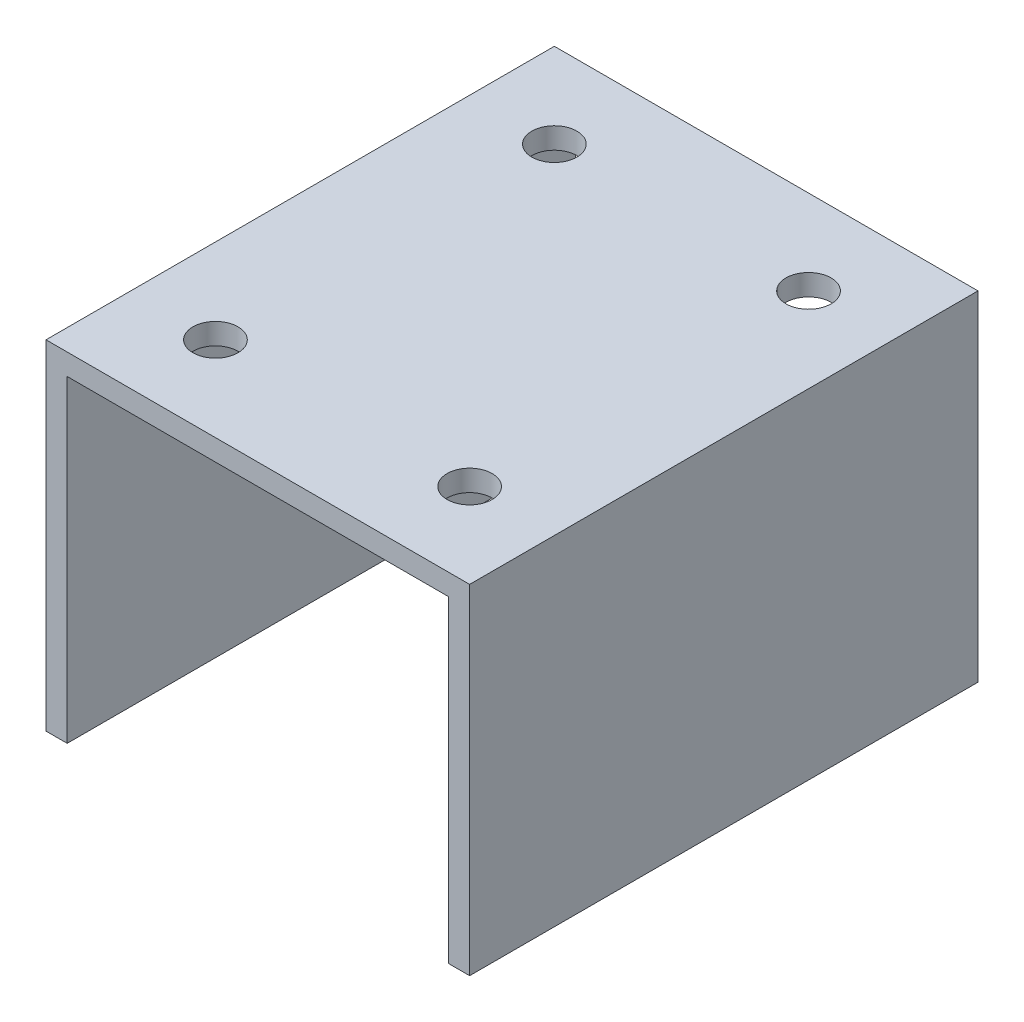
ISO-10303-21;
HEADER;
FILE_DESCRIPTION(('STEP AP214'),'2;1');
FILE_NAME('part.step','',(''),(''),'','','');
FILE_SCHEMA(('AUTOMOTIVE_DESIGN { 1 0 10303 214 1 1 1 1 }'));
ENDSEC;
DATA;
#1=APPLICATION_CONTEXT('core data for automotive mechanical design processes');
#2=APPLICATION_PROTOCOL_DEFINITION('international standard','automotive_design',2000,#1);
#3=PRODUCT_CONTEXT('',#1,'mechanical');
#4=PRODUCT('Part','Part','',(#3));
#5=PRODUCT_RELATED_PRODUCT_CATEGORY('part','',(#4));
#6=PRODUCT_DEFINITION_FORMATION('','',#4);
#7=PRODUCT_DEFINITION_CONTEXT('part definition',#1,'design');
#8=PRODUCT_DEFINITION('design','',#6,#7);
#9=PRODUCT_DEFINITION_SHAPE('','',#8);
#10=(LENGTH_UNIT() NAMED_UNIT(*) SI_UNIT(.MILLI.,.METRE.));
#11=(NAMED_UNIT(*) PLANE_ANGLE_UNIT() SI_UNIT($,.RADIAN.));
#12=(NAMED_UNIT(*) SI_UNIT($,.STERADIAN.) SOLID_ANGLE_UNIT());
#13=UNCERTAINTY_MEASURE_WITH_UNIT(LENGTH_MEASURE(1.E-05),#10,'distance_accuracy_value','');
#14=(GEOMETRIC_REPRESENTATION_CONTEXT(3) GLOBAL_UNCERTAINTY_ASSIGNED_CONTEXT((#13)) GLOBAL_UNIT_ASSIGNED_CONTEXT((#10,
#11,#12)) REPRESENTATION_CONTEXT('',''));
#15=CARTESIAN_POINT('',(0.,0.,0.));
#16=DIRECTION('',(0.,0.,1.));
#17=DIRECTION('',(1.,0.,0.));
#18=AXIS2_PLACEMENT_3D('',#15,#16,#17);
#19=CARTESIAN_POINT('',(-31.75,3.175,38.1));
#20=DIRECTION('',(1.,0.,0.));
#21=DIRECTION('',(0.,0.,-1.));
#22=AXIS2_PLACEMENT_3D('',#19,#20,#21);
#23=PLANE('',#22);
#24=DIRECTION('',(0.,-1.,0.));
#25=VECTOR('',#24,1.);
#26=CARTESIAN_POINT('',(-31.75,3.175,-38.1));
#27=LINE('',#26,#25);
#28=CARTESIAN_POINT('',(-31.75,3.175,-38.1));
#29=VERTEX_POINT('',#28);
#30=CARTESIAN_POINT('',(-31.75,-47.625,-38.1));
#31=VERTEX_POINT('',#30);
#32=EDGE_CURVE('E130',#29,#31,#27,.T.);
#33=ORIENTED_EDGE('',*,*,#32,.T.);
#34=DIRECTION('',(0.,0.,-1.));
#35=VECTOR('',#34,1.);
#36=CARTESIAN_POINT('',(-31.75,-47.625,38.1));
#37=LINE('',#36,#35);
#38=CARTESIAN_POINT('',(-31.75,-47.625,38.1));
#39=VERTEX_POINT('',#38);
#40=EDGE_CURVE('E11',#39,#31,#37,.T.);
#41=ORIENTED_EDGE('',*,*,#40,.F.);
#42=DIRECTION('',(0.,-1.,0.));
#43=VECTOR('',#42,1.);
#44=CARTESIAN_POINT('',(-31.75,3.175,38.1));
#45=LINE('',#44,#43);
#46=CARTESIAN_POINT('',(-31.75,3.175,38.1));
#47=VERTEX_POINT('',#46);
#48=EDGE_CURVE('E145',#47,#39,#45,.T.);
#49=ORIENTED_EDGE('',*,*,#48,.F.);
#50=DIRECTION('',(0.,0.,-1.));
#51=VECTOR('',#50,1.);
#52=CARTESIAN_POINT('',(-31.75,3.175,38.1));
#53=LINE('',#52,#51);
#54=EDGE_CURVE('E126',#47,#29,#53,.T.);
#55=ORIENTED_EDGE('',*,*,#54,.T.);
#56=EDGE_LOOP('',(#33,#41,#49,#55));
#57=FACE_BOUND('',#56,.T.);
#58=ADVANCED_FACE('F33',(#57),#23,.F.);
#59=CARTESIAN_POINT('',(-31.75,-47.625,38.1));
#60=DIRECTION('',(0.,1.,0.));
#61=DIRECTION('',(0.,0.,1.));
#62=AXIS2_PLACEMENT_3D('',#59,#60,#61);
#63=PLANE('',#62);
#64=DIRECTION('',(1.,0.,0.));
#65=VECTOR('',#64,1.);
#66=CARTESIAN_POINT('',(-31.75,-47.625,-38.1));
#67=LINE('',#66,#65);
#68=CARTESIAN_POINT('',(-28.575,-47.625,-38.1));
#69=VERTEX_POINT('',#68);
#70=EDGE_CURVE('E133',#31,#69,#67,.T.);
#71=ORIENTED_EDGE('',*,*,#70,.T.);
#72=DIRECTION('',(0.,0.,-1.));
#73=VECTOR('',#72,1.);
#74=CARTESIAN_POINT('',(-28.575,-47.625,38.1));
#75=LINE('',#74,#73);
#76=CARTESIAN_POINT('',(-28.575,-47.625,38.1));
#77=VERTEX_POINT('',#76);
#78=EDGE_CURVE('E42',#77,#69,#75,.T.);
#79=ORIENTED_EDGE('',*,*,#78,.F.);
#80=DIRECTION('',(1.,0.,0.));
#81=VECTOR('',#80,1.);
#82=CARTESIAN_POINT('',(-31.75,-47.625,38.1));
#83=LINE('',#82,#81);
#84=EDGE_CURVE('E93',#39,#77,#83,.T.);
#85=ORIENTED_EDGE('',*,*,#84,.F.);
#86=ORIENTED_EDGE('',*,*,#40,.T.);
#87=EDGE_LOOP('',(#71,#79,#85,#86));
#88=FACE_BOUND('',#87,.T.);
#89=ADVANCED_FACE('F229',(#88),#63,.F.);
#90=CARTESIAN_POINT('',(-28.575,-47.625,38.1));
#91=DIRECTION('',(-1.,0.,0.));
#92=DIRECTION('',(0.,-1.,0.));
#93=AXIS2_PLACEMENT_3D('',#90,#91,#92);
#94=PLANE('',#93);
#95=DIRECTION('',(0.,1.,0.));
#96=VECTOR('',#95,1.);
#97=CARTESIAN_POINT('',(-28.575,-47.625,-38.1));
#98=LINE('',#97,#96);
#99=CARTESIAN_POINT('',(-28.575,0.,-38.1));
#100=VERTEX_POINT('',#99);
#101=EDGE_CURVE('E136',#69,#100,#98,.T.);
#102=ORIENTED_EDGE('',*,*,#101,.T.);
#103=DIRECTION('',(0.,0.,-1.));
#104=VECTOR('',#103,1.);
#105=CARTESIAN_POINT('',(-28.575,0.,38.1));
#106=LINE('',#105,#104);
#107=CARTESIAN_POINT('',(-28.575,0.,38.1));
#108=VERTEX_POINT('',#107);
#109=EDGE_CURVE('E152',#108,#100,#106,.T.);
#110=ORIENTED_EDGE('',*,*,#109,.F.);
#111=DIRECTION('',(0.,1.,0.));
#112=VECTOR('',#111,1.);
#113=CARTESIAN_POINT('',(-28.575,-47.625,38.1));
#114=LINE('',#113,#112);
#115=EDGE_CURVE('E161',#77,#108,#114,.T.);
#116=ORIENTED_EDGE('',*,*,#115,.F.);
#117=ORIENTED_EDGE('',*,*,#78,.T.);
#118=EDGE_LOOP('',(#102,#110,#116,#117));
#119=FACE_BOUND('',#118,.T.);
#120=ADVANCED_FACE('F159',(#119),#94,.F.);
#121=CARTESIAN_POINT('',(-28.575,0.,38.1));
#122=DIRECTION('',(0.,1.,0.));
#123=DIRECTION('',(0.,0.,1.));
#124=AXIS2_PLACEMENT_3D('',#121,#122,#123);
#125=PLANE('',#124);
#126=CARTESIAN_POINT('',(-19.05,0.,-25.4));
#127=DIRECTION('',(0.,1.,0.));
#128=DIRECTION('',(0.,0.,1.));
#129=AXIS2_PLACEMENT_3D('',#126,#127,#128);
#130=CIRCLE('',#129,3.37819999999999);
#131=CARTESIAN_POINT('',(-19.05,0.,-22.0218));
#132=VERTEX_POINT('',#131);
#133=EDGE_CURVE('E193',#132,#132,#130,.T.);
#134=ORIENTED_EDGE('',*,*,#133,.T.);
#135=EDGE_LOOP('',(#134));
#136=FACE_BOUND('',#135,.T.);
#137=CARTESIAN_POINT('',(19.05,0.,-25.4));
#138=DIRECTION('',(0.,1.,0.));
#139=DIRECTION('',(0.,0.,1.));
#140=AXIS2_PLACEMENT_3D('',#137,#138,#139);
#141=CIRCLE('',#140,3.37819999999999);
#142=CARTESIAN_POINT('',(19.05,0.,-22.0218));
#143=VERTEX_POINT('',#142);
#144=EDGE_CURVE('E187',#143,#143,#141,.T.);
#145=ORIENTED_EDGE('',*,*,#144,.T.);
#146=EDGE_LOOP('',(#145));
#147=FACE_BOUND('',#146,.T.);
#148=CARTESIAN_POINT('',(19.05,0.,25.4));
#149=DIRECTION('',(0.,1.,0.));
#150=DIRECTION('',(0.,0.,1.));
#151=AXIS2_PLACEMENT_3D('',#148,#149,#150);
#152=CIRCLE('',#151,3.37819999999999);
#153=CARTESIAN_POINT('',(19.05,0.,28.7782));
#154=VERTEX_POINT('',#153);
#155=EDGE_CURVE('E36',#154,#154,#152,.T.);
#156=ORIENTED_EDGE('',*,*,#155,.T.);
#157=EDGE_LOOP('',(#156));
#158=FACE_BOUND('',#157,.T.);
#159=CARTESIAN_POINT('',(-19.05,0.,25.4));
#160=DIRECTION('',(0.,1.,0.));
#161=DIRECTION('',(0.,0.,1.));
#162=AXIS2_PLACEMENT_3D('',#159,#160,#161);
#163=CIRCLE('',#162,3.37819999999999);
#164=CARTESIAN_POINT('',(-19.05,0.,28.7782));
#165=VERTEX_POINT('',#164);
#166=EDGE_CURVE('E134',#165,#165,#163,.T.);
#167=ORIENTED_EDGE('',*,*,#166,.T.);
#168=EDGE_LOOP('',(#167));
#169=FACE_BOUND('',#168,.T.);
#170=DIRECTION('',(1.,0.,0.));
#171=VECTOR('',#170,1.);
#172=CARTESIAN_POINT('',(-28.575,0.,-38.1));
#173=LINE('',#172,#171);
#174=CARTESIAN_POINT('',(28.575,0.,-38.1));
#175=VERTEX_POINT('',#174);
#176=EDGE_CURVE('E138',#100,#175,#173,.T.);
#177=ORIENTED_EDGE('',*,*,#176,.T.);
#178=DIRECTION('',(0.,0.,-1.));
#179=VECTOR('',#178,1.);
#180=CARTESIAN_POINT('',(28.575,0.,38.1));
#181=LINE('',#180,#179);
#182=CARTESIAN_POINT('',(28.575,0.,38.1));
#183=VERTEX_POINT('',#182);
#184=EDGE_CURVE('E149',#183,#175,#181,.T.);
#185=ORIENTED_EDGE('',*,*,#184,.F.);
#186=DIRECTION('',(1.,0.,0.));
#187=VECTOR('',#186,1.);
#188=CARTESIAN_POINT('',(-28.575,0.,38.1));
#189=LINE('',#188,#187);
#190=EDGE_CURVE('E173',#108,#183,#189,.T.);
#191=ORIENTED_EDGE('',*,*,#190,.F.);
#192=ORIENTED_EDGE('',*,*,#109,.T.);
#193=EDGE_LOOP('',(#177,#185,#191,#192));
#194=FACE_BOUND('',#193,.T.);
#195=ADVANCED_FACE('F169',(#136,#147,#158,#169,#194),#125,.F.);
#196=CARTESIAN_POINT('',(28.575,-47.625,38.1));
#197=DIRECTION('',(1.,0.,0.));
#198=DIRECTION('',(0.,1.,0.));
#199=AXIS2_PLACEMENT_3D('',#196,#197,#198);
#200=PLANE('',#199);
#201=DIRECTION('',(0.,-1.,0.));
#202=VECTOR('',#201,1.);
#203=CARTESIAN_POINT('',(28.575,-47.625,-38.1));
#204=LINE('',#203,#202);
#205=CARTESIAN_POINT('',(28.575,-47.625,-38.1));
#206=VERTEX_POINT('',#205);
#207=EDGE_CURVE('E140',#175,#206,#204,.T.);
#208=ORIENTED_EDGE('',*,*,#207,.T.);
#209=DIRECTION('',(0.,0.,-1.));
#210=VECTOR('',#209,1.);
#211=CARTESIAN_POINT('',(28.575,-47.625,38.1));
#212=LINE('',#211,#210);
#213=CARTESIAN_POINT('',(28.575,-47.625,38.1));
#214=VERTEX_POINT('',#213);
#215=EDGE_CURVE('E121',#214,#206,#212,.T.);
#216=ORIENTED_EDGE('',*,*,#215,.F.);
#217=DIRECTION('',(0.,-1.,0.));
#218=VECTOR('',#217,1.);
#219=CARTESIAN_POINT('',(28.575,-47.625,38.1));
#220=LINE('',#219,#218);
#221=EDGE_CURVE('E112',#183,#214,#220,.T.);
#222=ORIENTED_EDGE('',*,*,#221,.F.);
#223=ORIENTED_EDGE('',*,*,#184,.T.);
#224=EDGE_LOOP('',(#208,#216,#222,#223));
#225=FACE_BOUND('',#224,.T.);
#226=ADVANCED_FACE('F172',(#225),#200,.F.);
#227=CARTESIAN_POINT('',(28.575,-47.625,38.1));
#228=DIRECTION('',(0.,1.,0.));
#229=DIRECTION('',(0.,0.,1.));
#230=AXIS2_PLACEMENT_3D('',#227,#228,#229);
#231=PLANE('',#230);
#232=DIRECTION('',(1.,0.,0.));
#233=VECTOR('',#232,1.);
#234=CARTESIAN_POINT('',(28.575,-47.625,-38.1));
#235=LINE('',#234,#233);
#236=CARTESIAN_POINT('',(31.75,-47.625,-38.1));
#237=VERTEX_POINT('',#236);
#238=EDGE_CURVE('E120',#206,#237,#235,.T.);
#239=ORIENTED_EDGE('',*,*,#238,.T.);
#240=DIRECTION('',(0.,0.,-1.));
#241=VECTOR('',#240,1.);
#242=CARTESIAN_POINT('',(31.75,-47.625,38.1));
#243=LINE('',#242,#241);
#244=CARTESIAN_POINT('',(31.75,-47.625,38.1));
#245=VERTEX_POINT('',#244);
#246=EDGE_CURVE('E117',#245,#237,#243,.T.);
#247=ORIENTED_EDGE('',*,*,#246,.F.);
#248=DIRECTION('',(1.,0.,0.));
#249=VECTOR('',#248,1.);
#250=CARTESIAN_POINT('',(28.575,-47.625,38.1));
#251=LINE('',#250,#249);
#252=EDGE_CURVE('E106',#214,#245,#251,.T.);
#253=ORIENTED_EDGE('',*,*,#252,.F.);
#254=ORIENTED_EDGE('',*,*,#215,.T.);
#255=EDGE_LOOP('',(#239,#247,#253,#254));
#256=FACE_BOUND('',#255,.T.);
#257=ADVANCED_FACE('F118',(#256),#231,.F.);
#258=CARTESIAN_POINT('',(31.75,3.175,38.1));
#259=DIRECTION('',(-1.,0.,0.));
#260=DIRECTION('',(0.,0.,1.));
#261=AXIS2_PLACEMENT_3D('',#258,#259,#260);
#262=PLANE('',#261);
#263=DIRECTION('',(0.,1.,0.));
#264=VECTOR('',#263,1.);
#265=CARTESIAN_POINT('',(31.75,3.175,-38.1));
#266=LINE('',#265,#264);
#267=CARTESIAN_POINT('',(31.75,3.175,-38.1));
#268=VERTEX_POINT('',#267);
#269=EDGE_CURVE('E79',#237,#268,#266,.T.);
#270=ORIENTED_EDGE('',*,*,#269,.T.);
#271=DIRECTION('',(0.,0.,-1.));
#272=VECTOR('',#271,1.);
#273=CARTESIAN_POINT('',(31.75,3.175,38.1));
#274=LINE('',#273,#272);
#275=CARTESIAN_POINT('',(31.75,3.175,38.1));
#276=VERTEX_POINT('',#275);
#277=EDGE_CURVE('E122',#276,#268,#274,.T.);
#278=ORIENTED_EDGE('',*,*,#277,.F.);
#279=DIRECTION('',(0.,1.,0.));
#280=VECTOR('',#279,1.);
#281=CARTESIAN_POINT('',(31.75,3.175,38.1));
#282=LINE('',#281,#280);
#283=EDGE_CURVE('E110',#245,#276,#282,.T.);
#284=ORIENTED_EDGE('',*,*,#283,.F.);
#285=ORIENTED_EDGE('',*,*,#246,.T.);
#286=EDGE_LOOP('',(#270,#278,#284,#285));
#287=FACE_BOUND('',#286,.T.);
#288=ADVANCED_FACE('F124',(#287),#262,.F.);
#289=CARTESIAN_POINT('',(-31.75,3.175,38.1));
#290=DIRECTION('',(0.,-1.,0.));
#291=DIRECTION('',(0.,0.,-1.));
#292=AXIS2_PLACEMENT_3D('',#289,#290,#291);
#293=PLANE('',#292);
#294=CARTESIAN_POINT('',(-19.05,3.175,-25.4));
#295=DIRECTION('',(0.,1.,0.));
#296=DIRECTION('',(0.,0.,1.));
#297=AXIS2_PLACEMENT_3D('',#294,#295,#296);
#298=CIRCLE('',#297,3.3782);
#299=CARTESIAN_POINT('',(-19.05,3.175,-22.0218));
#300=VERTEX_POINT('',#299);
#301=EDGE_CURVE('E196',#300,#300,#298,.T.);
#302=ORIENTED_EDGE('',*,*,#301,.F.);
#303=EDGE_LOOP('',(#302));
#304=FACE_BOUND('',#303,.T.);
#305=CARTESIAN_POINT('',(19.05,3.175,-25.4));
#306=DIRECTION('',(0.,1.,0.));
#307=DIRECTION('',(0.,0.,1.));
#308=AXIS2_PLACEMENT_3D('',#305,#306,#307);
#309=CIRCLE('',#308,3.3782);
#310=CARTESIAN_POINT('',(19.05,3.175,-22.0218));
#311=VERTEX_POINT('',#310);
#312=EDGE_CURVE('E190',#311,#311,#309,.T.);
#313=ORIENTED_EDGE('',*,*,#312,.F.);
#314=EDGE_LOOP('',(#313));
#315=FACE_BOUND('',#314,.T.);
#316=CARTESIAN_POINT('',(19.05,3.175,25.4));
#317=DIRECTION('',(0.,1.,0.));
#318=DIRECTION('',(0.,0.,1.));
#319=AXIS2_PLACEMENT_3D('',#316,#317,#318);
#320=CIRCLE('',#319,3.3782);
#321=CARTESIAN_POINT('',(19.05,3.175,28.7782));
#322=VERTEX_POINT('',#321);
#323=EDGE_CURVE('E184',#322,#322,#320,.T.);
#324=ORIENTED_EDGE('',*,*,#323,.F.);
#325=EDGE_LOOP('',(#324));
#326=FACE_BOUND('',#325,.T.);
#327=CARTESIAN_POINT('',(-19.05,3.175,25.4));
#328=DIRECTION('',(0.,1.,0.));
#329=DIRECTION('',(0.,0.,1.));
#330=AXIS2_PLACEMENT_3D('',#327,#328,#329);
#331=CIRCLE('',#330,3.3782);
#332=CARTESIAN_POINT('',(-19.05,3.175,28.7782));
#333=VERTEX_POINT('',#332);
#334=EDGE_CURVE('E181',#333,#333,#331,.T.);
#335=ORIENTED_EDGE('',*,*,#334,.F.);
#336=EDGE_LOOP('',(#335));
#337=FACE_BOUND('',#336,.T.);
#338=DIRECTION('',(-1.,0.,0.));
#339=VECTOR('',#338,1.);
#340=CARTESIAN_POINT('',(-31.75,3.175,-38.1));
#341=LINE('',#340,#339);
#342=EDGE_CURVE('E85',#268,#29,#341,.T.);
#343=ORIENTED_EDGE('',*,*,#342,.T.);
#344=ORIENTED_EDGE('',*,*,#54,.F.);
#345=DIRECTION('',(-1.,0.,0.));
#346=VECTOR('',#345,1.);
#347=CARTESIAN_POINT('',(-31.75,3.175,38.1));
#348=LINE('',#347,#346);
#349=EDGE_CURVE('E50',#276,#47,#348,.T.);
#350=ORIENTED_EDGE('',*,*,#349,.F.);
#351=ORIENTED_EDGE('',*,*,#277,.T.);
#352=EDGE_LOOP('',(#343,#344,#350,#351));
#353=FACE_BOUND('',#352,.T.);
#354=ADVANCED_FACE('F203',(#304,#315,#326,#337,#353),#293,.F.);
#355=CARTESIAN_POINT('',(0.,0.,38.1));
#356=DIRECTION('',(0.,0.,1.));
#357=DIRECTION('',(1.,0.,0.));
#358=AXIS2_PLACEMENT_3D('',#355,#356,#357);
#359=PLANE('',#358);
#360=ORIENTED_EDGE('',*,*,#48,.T.);
#361=ORIENTED_EDGE('',*,*,#84,.T.);
#362=ORIENTED_EDGE('',*,*,#115,.T.);
#363=ORIENTED_EDGE('',*,*,#190,.T.);
#364=ORIENTED_EDGE('',*,*,#221,.T.);
#365=ORIENTED_EDGE('',*,*,#252,.T.);
#366=ORIENTED_EDGE('',*,*,#283,.T.);
#367=ORIENTED_EDGE('',*,*,#349,.T.);
#368=EDGE_LOOP('',(#360,#361,#362,#363,#364,#365,#366,#367));
#369=FACE_BOUND('',#368,.T.);
#370=ADVANCED_FACE('F108',(#369),#359,.T.);
#371=CARTESIAN_POINT('',(0.,0.,-38.1));
#372=DIRECTION('',(0.,0.,1.));
#373=DIRECTION('',(1.,0.,0.));
#374=AXIS2_PLACEMENT_3D('',#371,#372,#373);
#375=PLANE('',#374);
#376=ORIENTED_EDGE('',*,*,#32,.F.);
#377=ORIENTED_EDGE('',*,*,#342,.F.);
#378=ORIENTED_EDGE('',*,*,#269,.F.);
#379=ORIENTED_EDGE('',*,*,#238,.F.);
#380=ORIENTED_EDGE('',*,*,#207,.F.);
#381=ORIENTED_EDGE('',*,*,#176,.F.);
#382=ORIENTED_EDGE('',*,*,#101,.F.);
#383=ORIENTED_EDGE('',*,*,#70,.F.);
#384=EDGE_LOOP('',(#376,#377,#378,#379,#380,#381,#382,#383));
#385=FACE_BOUND('',#384,.T.);
#386=ADVANCED_FACE('F165',(#385),#375,.F.);
#387=CARTESIAN_POINT('',(-19.05,3.175,25.4));
#388=DIRECTION('',(0.,1.,0.));
#389=DIRECTION('',(0.,0.,1.));
#390=AXIS2_PLACEMENT_3D('',#387,#388,#389);
#391=CYLINDRICAL_SURFACE('',#390,3.37819999999999);
#392=ORIENTED_EDGE('',*,*,#334,.T.);
#393=EDGE_LOOP('',(#392));
#394=FACE_BOUND('',#393,.T.);
#395=ORIENTED_EDGE('',*,*,#166,.F.);
#396=EDGE_LOOP('',(#395));
#397=FACE_BOUND('',#396,.T.);
#398=ADVANCED_FACE('F213',(#394,#397),#391,.F.);
#399=CARTESIAN_POINT('',(19.05,3.175,25.4));
#400=DIRECTION('',(0.,1.,0.));
#401=DIRECTION('',(0.,0.,1.));
#402=AXIS2_PLACEMENT_3D('',#399,#400,#401);
#403=CYLINDRICAL_SURFACE('',#402,3.37819999999999);
#404=ORIENTED_EDGE('',*,*,#323,.T.);
#405=EDGE_LOOP('',(#404));
#406=FACE_BOUND('',#405,.T.);
#407=ORIENTED_EDGE('',*,*,#155,.F.);
#408=EDGE_LOOP('',(#407));
#409=FACE_BOUND('',#408,.T.);
#410=ADVANCED_FACE('F216',(#406,#409),#403,.F.);
#411=CARTESIAN_POINT('',(19.05,3.175,-25.4));
#412=DIRECTION('',(0.,1.,0.));
#413=DIRECTION('',(0.,0.,1.));
#414=AXIS2_PLACEMENT_3D('',#411,#412,#413);
#415=CYLINDRICAL_SURFACE('',#414,3.37819999999999);
#416=ORIENTED_EDGE('',*,*,#312,.T.);
#417=EDGE_LOOP('',(#416));
#418=FACE_BOUND('',#417,.T.);
#419=ORIENTED_EDGE('',*,*,#144,.F.);
#420=EDGE_LOOP('',(#419));
#421=FACE_BOUND('',#420,.T.);
#422=ADVANCED_FACE('F292',(#418,#421),#415,.F.);
#423=CARTESIAN_POINT('',(-19.05,3.175,-25.4));
#424=DIRECTION('',(0.,1.,0.));
#425=DIRECTION('',(0.,0.,1.));
#426=AXIS2_PLACEMENT_3D('',#423,#424,#425);
#427=CYLINDRICAL_SURFACE('',#426,3.37819999999999);
#428=ORIENTED_EDGE('',*,*,#301,.T.);
#429=EDGE_LOOP('',(#428));
#430=FACE_BOUND('',#429,.T.);
#431=ORIENTED_EDGE('',*,*,#133,.F.);
#432=EDGE_LOOP('',(#431));
#433=FACE_BOUND('',#432,.T.);
#434=ADVANCED_FACE('F200',(#430,#433),#427,.F.);
#435=CLOSED_SHELL('',(#58,#89,#120,#195,#226,#257,#288,#354,#370,#386,#398,#410,#422,#434));
#436=MANIFOLD_SOLID_BREP('B2',#435);
#437=ADVANCED_BREP_SHAPE_REPRESENTATION('',(#18,#436),#14);
#438=SHAPE_DEFINITION_REPRESENTATION(#9,#437);
ENDSEC;
END-ISO-10303-21;
